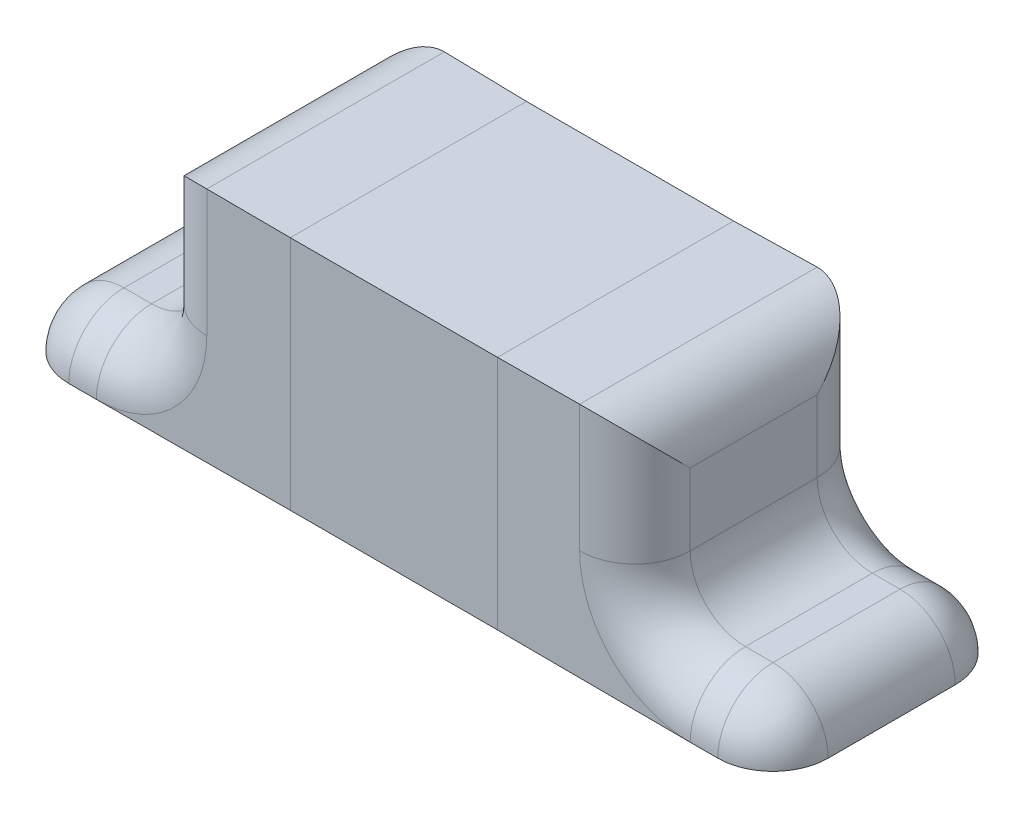
ISO-10303-21;
HEADER;
FILE_DESCRIPTION(('STEP AP214'),'2;1');
FILE_NAME('part.step','',(''),(''),'','','');
FILE_SCHEMA(('AUTOMOTIVE_DESIGN { 1 0 10303 214 1 1 1 1 }'));
ENDSEC;
DATA;
#1=APPLICATION_CONTEXT('core data for automotive mechanical design processes');
#2=APPLICATION_PROTOCOL_DEFINITION('international standard','automotive_design',2000,#1);
#3=PRODUCT_CONTEXT('',#1,'mechanical');
#4=PRODUCT('Part','Part','',(#3));
#5=PRODUCT_RELATED_PRODUCT_CATEGORY('part','',(#4));
#6=PRODUCT_DEFINITION_FORMATION('','',#4);
#7=PRODUCT_DEFINITION_CONTEXT('part definition',#1,'design');
#8=PRODUCT_DEFINITION('design','',#6,#7);
#9=PRODUCT_DEFINITION_SHAPE('','',#8);
#10=(LENGTH_UNIT() NAMED_UNIT(*) SI_UNIT(.MILLI.,.METRE.));
#11=(NAMED_UNIT(*) PLANE_ANGLE_UNIT() SI_UNIT($,.RADIAN.));
#12=(NAMED_UNIT(*) SI_UNIT($,.STERADIAN.) SOLID_ANGLE_UNIT());
#13=UNCERTAINTY_MEASURE_WITH_UNIT(LENGTH_MEASURE(1.E-05),#10,'distance_accuracy_value','');
#14=(GEOMETRIC_REPRESENTATION_CONTEXT(3) GLOBAL_UNCERTAINTY_ASSIGNED_CONTEXT((#13)) GLOBAL_UNIT_ASSIGNED_CONTEXT((#10,
#11,#12)) REPRESENTATION_CONTEXT('',''));
#15=CARTESIAN_POINT('',(0.,0.,0.));
#16=DIRECTION('',(0.,0.,1.));
#17=DIRECTION('',(1.,0.,0.));
#18=AXIS2_PLACEMENT_3D('',#15,#16,#17);
#19=CARTESIAN_POINT('',(0.875,0.,0.));
#20=DIRECTION('',(-1.,0.,0.));
#21=DIRECTION('',(0.,0.,1.));
#22=AXIS2_PLACEMENT_3D('',#19,#20,#21);
#23=PLANE('',#22);
#24=DIRECTION('',(0.,1.,0.));
#25=VECTOR('',#24,1.);
#26=CARTESIAN_POINT('',(0.875,0.,-0.23));
#27=LINE('',#26,#25);
#28=CARTESIAN_POINT('',(0.875,0.398442990090282,-0.23));
#29=VERTEX_POINT('',#28);
#30=CARTESIAN_POINT('',(0.875,0.658442990090282,-0.23));
#31=VERTEX_POINT('',#30);
#32=EDGE_CURVE('E897',#29,#31,#27,.T.);
#33=ORIENTED_EDGE('',*,*,#32,.T.);
#34=DIRECTION('',(0.,0.,1.));
#35=VECTOR('',#34,1.);
#36=CARTESIAN_POINT('',(0.875,0.658442990090282,0.));
#37=LINE('',#36,#35);
#38=CARTESIAN_POINT('',(0.875,0.658442990090282,0.23));
#39=VERTEX_POINT('',#38);
#40=EDGE_CURVE('E455',#31,#39,#37,.T.);
#41=ORIENTED_EDGE('',*,*,#40,.T.);
#42=DIRECTION('',(0.,-1.,0.));
#43=VECTOR('',#42,1.);
#44=CARTESIAN_POINT('',(0.875,0.,0.23));
#45=LINE('',#44,#43);
#46=CARTESIAN_POINT('',(0.875,0.398442990090282,0.23));
#47=VERTEX_POINT('',#46);
#48=EDGE_CURVE('E919',#39,#47,#45,.T.);
#49=ORIENTED_EDGE('',*,*,#48,.T.);
#50=DIRECTION('',(0.,0.,1.));
#51=VECTOR('',#50,1.);
#52=CARTESIAN_POINT('',(0.875,0.398442990090282,-0.43));
#53=LINE('',#52,#51);
#54=EDGE_CURVE('E250',#47,#29,#53,.F.);
#55=ORIENTED_EDGE('',*,*,#54,.T.);
#56=EDGE_LOOP('',(#33,#41,#49,#55));
#57=FACE_BOUND('',#56,.T.);
#58=ADVANCED_FACE('F39',(#57),#23,.F.);
#59=CARTESIAN_POINT('',(0.375,0.,-0.425));
#60=DIRECTION('',(0.,0.,1.));
#61=DIRECTION('',(1.,0.,0.));
#62=AXIS2_PLACEMENT_3D('',#59,#60,#61);
#63=PLANE('',#62);
#64=CARTESIAN_POINT('',(-0.375,0.,-0.425));
#65=DIRECTION('',(0.,1.,0.));
#66=VECTOR('',#65,1.);
#67=LINE('',#64,#66);
#68=CARTESIAN_POINT('',(-0.375,-0.000778504954858498,-0.4275));
#69=VERTEX_POINT('',#68);
#70=CARTESIAN_POINT('',(-0.375,0.854221495045141,-0.4275));
#71=VERTEX_POINT('',#70);
#72=EDGE_CURVE('E202',#69,#71,#67,.T.);
#73=ORIENTED_EDGE('',*,*,#72,.T.);
#74=DIRECTION('',(-1.,0.,0.));
#75=VECTOR('',#74,1.);
#76=CARTESIAN_POINT('',(0.375,0.850000000000001,-0.425));
#77=LINE('',#76,#75);
#78=CARTESIAN_POINT('',(0.375,0.854221495045141,-0.4275));
#79=VERTEX_POINT('',#78);
#80=EDGE_CURVE('E247',#79,#71,#77,.T.);
#81=ORIENTED_EDGE('',*,*,#80,.F.);
#82=CARTESIAN_POINT('',(0.375,-0.00155700990971792,-0.43));
#83=DIRECTION('',(0.,1.,0.));
#84=VECTOR('',#83,1.);
#85=LINE('',#82,#84);
#86=CARTESIAN_POINT('',(0.375,-0.000778504954858498,-0.4275));
#87=VERTEX_POINT('',#86);
#88=EDGE_CURVE('E227',#87,#79,#85,.T.);
#89=ORIENTED_EDGE('',*,*,#88,.F.);
#90=DIRECTION('',(-1.,0.,0.));
#91=VECTOR('',#90,1.);
#92=CARTESIAN_POINT('',(0.375,0.,-0.425));
#93=LINE('',#92,#91);
#94=EDGE_CURVE('E223',#87,#69,#93,.T.);
#95=ORIENTED_EDGE('',*,*,#94,.T.);
#96=EDGE_LOOP('',(#73,#81,#89,#95));
#97=FACE_BOUND('',#96,.T.);
#98=ADVANCED_FACE('F232',(#97),#63,.F.);
#99=CARTESIAN_POINT('',(0.375,0.850000000000001,0.425));
#100=DIRECTION('',(0.,-1.,0.));
#101=DIRECTION('',(0.,0.,-1.));
#102=AXIS2_PLACEMENT_3D('',#99,#100,#101);
#103=PLANE('',#102);
#104=CARTESIAN_POINT('',(-0.375,0.850000000000001,-0.425));
#105=DIRECTION('',(0.,0.,1.));
#106=VECTOR('',#105,1.);
#107=LINE('',#104,#106);
#108=CARTESIAN_POINT('',(-0.375,0.854221495045141,0.4275));
#109=VERTEX_POINT('',#108);
#110=EDGE_CURVE('E213',#71,#109,#107,.T.);
#111=ORIENTED_EDGE('',*,*,#110,.T.);
#112=DIRECTION('',(-1.,0.,0.));
#113=VECTOR('',#112,1.);
#114=CARTESIAN_POINT('',(0.375,0.850000000000001,0.425));
#115=LINE('',#114,#113);
#116=CARTESIAN_POINT('',(0.375,0.854221495045141,0.4275));
#117=VERTEX_POINT('',#116);
#118=EDGE_CURVE('E237',#117,#109,#115,.T.);
#119=ORIENTED_EDGE('',*,*,#118,.F.);
#120=CARTESIAN_POINT('',(0.375,0.858442990090282,-0.43));
#121=DIRECTION('',(0.,0.,1.));
#122=VECTOR('',#121,1.);
#123=LINE('',#120,#122);
#124=EDGE_CURVE('E258',#79,#117,#123,.T.);
#125=ORIENTED_EDGE('',*,*,#124,.F.);
#126=ORIENTED_EDGE('',*,*,#80,.T.);
#127=EDGE_LOOP('',(#111,#119,#125,#126));
#128=FACE_BOUND('',#127,.T.);
#129=ADVANCED_FACE('F264',(#128),#103,.F.);
#130=CARTESIAN_POINT('',(0.375,0.,0.425));
#131=DIRECTION('',(0.,0.,-1.));
#132=DIRECTION('',(-1.,0.,0.));
#133=AXIS2_PLACEMENT_3D('',#130,#131,#132);
#134=PLANE('',#133);
#135=CARTESIAN_POINT('',(-0.375,0.850000000000001,0.425));
#136=DIRECTION('',(0.,-1.,0.));
#137=VECTOR('',#136,1.);
#138=LINE('',#135,#137);
#139=CARTESIAN_POINT('',(-0.375,-0.000778504954858524,0.4275));
#140=VERTEX_POINT('',#139);
#141=EDGE_CURVE('E228',#109,#140,#138,.T.);
#142=ORIENTED_EDGE('',*,*,#141,.T.);
#143=DIRECTION('',(-1.,0.,0.));
#144=VECTOR('',#143,1.);
#145=CARTESIAN_POINT('',(0.375,0.,0.425));
#146=LINE('',#145,#144);
#147=CARTESIAN_POINT('',(0.375,-0.000778504954858524,0.4275));
#148=VERTEX_POINT('',#147);
#149=EDGE_CURVE('E226',#148,#140,#146,.T.);
#150=ORIENTED_EDGE('',*,*,#149,.F.);
#151=CARTESIAN_POINT('',(0.375,0.858442990090282,0.43));
#152=DIRECTION('',(0.,-1.,0.));
#153=VECTOR('',#152,1.);
#154=LINE('',#151,#153);
#155=EDGE_CURVE('E239',#117,#148,#154,.T.);
#156=ORIENTED_EDGE('',*,*,#155,.F.);
#157=ORIENTED_EDGE('',*,*,#118,.T.);
#158=EDGE_LOOP('',(#142,#150,#156,#157));
#159=FACE_BOUND('',#158,.T.);
#160=ADVANCED_FACE('F273',(#159),#134,.F.);
#161=CARTESIAN_POINT('',(0.375,0.,0.425));
#162=DIRECTION('',(0.,1.,0.));
#163=DIRECTION('',(0.,0.,1.));
#164=AXIS2_PLACEMENT_3D('',#161,#162,#163);
#165=PLANE('',#164);
#166=CARTESIAN_POINT('',(-0.375,0.,0.425));
#167=DIRECTION('',(0.,0.,-1.));
#168=VECTOR('',#167,1.);
#169=LINE('',#166,#168);
#170=EDGE_CURVE('E192',#140,#69,#169,.T.);
#171=ORIENTED_EDGE('',*,*,#170,.T.);
#172=ORIENTED_EDGE('',*,*,#94,.F.);
#173=CARTESIAN_POINT('',(0.375,-0.00155700990971797,0.43));
#174=DIRECTION('',(0.,0.,-1.));
#175=VECTOR('',#174,1.);
#176=LINE('',#173,#175);
#177=EDGE_CURVE('E235',#148,#87,#176,.T.);
#178=ORIENTED_EDGE('',*,*,#177,.F.);
#179=ORIENTED_EDGE('',*,*,#149,.T.);
#180=EDGE_LOOP('',(#171,#172,#178,#179));
#181=FACE_BOUND('',#180,.T.);
#182=ADVANCED_FACE('F221',(#181),#165,.F.);
#183=CARTESIAN_POINT('',(0.875,-0.00155700990971792,-0.43));
#184=DIRECTION('',(0.,0.,1.));
#185=DIRECTION('',(1.,0.,0.));
#186=AXIS2_PLACEMENT_3D('',#183,#184,#185);
#187=PLANE('',#186);
#188=DIRECTION('',(-1.,0.,0.));
#189=VECTOR('',#188,1.);
#190=CARTESIAN_POINT('',(0.875,0.858442990090282,-0.43));
#191=LINE('',#190,#189);
#192=CARTESIAN_POINT('',(0.675,0.858442990090282,-0.43));
#193=VERTEX_POINT('',#192);
#194=EDGE_CURVE('E214',#193,#79,#191,.T.);
#195=ORIENTED_EDGE('',*,*,#194,.F.);
#196=DIRECTION('',(0.,1.,0.));
#197=VECTOR('',#196,1.);
#198=CARTESIAN_POINT('',(0.675,-0.00155700990971792,-0.43));
#199=LINE('',#198,#197);
#200=CARTESIAN_POINT('',(0.675,0.398442990090282,-0.43));
#201=VERTEX_POINT('',#200);
#202=EDGE_CURVE('E454',#193,#201,#199,.F.);
#203=ORIENTED_EDGE('',*,*,#202,.T.);
#204=CARTESIAN_POINT('',(1.075,0.398442990090282,-0.43));
#205=DIRECTION('',(0.,0.,1.));
#206=DIRECTION('',(1.,0.,0.));
#207=AXIS2_PLACEMENT_3D('',#204,#205,#206);
#208=CIRCLE('',#207,0.4);
#209=CARTESIAN_POINT('',(1.075,-0.00155700990971792,-0.43));
#210=VERTEX_POINT('',#209);
#211=EDGE_CURVE('E451',#210,#201,#208,.F.);
#212=ORIENTED_EDGE('',*,*,#211,.F.);
#213=DIRECTION('',(-1.,0.,0.));
#214=VECTOR('',#213,1.);
#215=CARTESIAN_POINT('',(0.875,-0.00155700990971792,-0.43));
#216=LINE('',#215,#214);
#217=EDGE_CURVE('E446',#210,#87,#216,.T.);
#218=ORIENTED_EDGE('',*,*,#217,.T.);
#219=ORIENTED_EDGE('',*,*,#88,.T.);
#220=EDGE_LOOP('',(#195,#203,#212,#218,#219));
#221=FACE_BOUND('',#220,.T.);
#222=ADVANCED_FACE('F422',(#221),#187,.F.);
#223=CARTESIAN_POINT('',(0.875,0.858442990090282,0.43));
#224=DIRECTION('',(0.,-1.,0.));
#225=DIRECTION('',(0.,0.,-1.));
#226=AXIS2_PLACEMENT_3D('',#223,#224,#225);
#227=PLANE('',#226);
#228=DIRECTION('',(-1.,0.,0.));
#229=VECTOR('',#228,1.);
#230=CARTESIAN_POINT('',(0.875,0.858442990090282,0.43));
#231=LINE('',#230,#229);
#232=CARTESIAN_POINT('',(0.675,0.858442990090282,0.43));
#233=VERTEX_POINT('',#232);
#234=EDGE_CURVE('E400',#233,#117,#231,.T.);
#235=ORIENTED_EDGE('',*,*,#234,.F.);
#236=DIRECTION('',(0.,0.,1.));
#237=VECTOR('',#236,1.);
#238=CARTESIAN_POINT('',(0.675,0.858442990090282,0.43));
#239=LINE('',#238,#237);
#240=EDGE_CURVE('E912',#233,#193,#239,.F.);
#241=ORIENTED_EDGE('',*,*,#240,.T.);
#242=ORIENTED_EDGE('',*,*,#194,.T.);
#243=ORIENTED_EDGE('',*,*,#124,.T.);
#244=EDGE_LOOP('',(#235,#241,#242,#243));
#245=FACE_BOUND('',#244,.T.);
#246=ADVANCED_FACE('F399',(#245),#227,.F.);
#247=CARTESIAN_POINT('',(0.875,-0.00155700990971797,0.43));
#248=DIRECTION('',(0.,0.,-1.));
#249=DIRECTION('',(-1.,0.,0.));
#250=AXIS2_PLACEMENT_3D('',#247,#248,#249);
#251=PLANE('',#250);
#252=CARTESIAN_POINT('',(1.075,0.398442990090282,0.43));
#253=DIRECTION('',(0.,0.,-1.));
#254=DIRECTION('',(-1.,0.,0.));
#255=AXIS2_PLACEMENT_3D('',#252,#253,#254);
#256=CIRCLE('',#255,0.4);
#257=CARTESIAN_POINT('',(0.675,0.398442990090282,0.43));
#258=VERTEX_POINT('',#257);
#259=CARTESIAN_POINT('',(1.075,-0.00155700990971797,0.43));
#260=VERTEX_POINT('',#259);
#261=EDGE_CURVE('E458',#258,#260,#256,.F.);
#262=ORIENTED_EDGE('',*,*,#261,.F.);
#263=DIRECTION('',(0.,-1.,0.));
#264=VECTOR('',#263,1.);
#265=CARTESIAN_POINT('',(0.675,-0.00155700990971797,0.43));
#266=LINE('',#265,#264);
#267=EDGE_CURVE('E914',#258,#233,#266,.F.);
#268=ORIENTED_EDGE('',*,*,#267,.T.);
#269=ORIENTED_EDGE('',*,*,#234,.T.);
#270=ORIENTED_EDGE('',*,*,#155,.T.);
#271=DIRECTION('',(-1.,0.,0.));
#272=VECTOR('',#271,1.);
#273=CARTESIAN_POINT('',(0.875,-0.00155700990971797,0.43));
#274=LINE('',#273,#272);
#275=EDGE_CURVE('E459',#260,#148,#274,.T.);
#276=ORIENTED_EDGE('',*,*,#275,.F.);
#277=EDGE_LOOP('',(#262,#268,#269,#270,#276));
#278=FACE_BOUND('',#277,.T.);
#279=ADVANCED_FACE('F421',(#278),#251,.F.);
#280=CARTESIAN_POINT('',(0.875,-0.00155700990971797,0.43));
#281=DIRECTION('',(0.,1.,0.));
#282=DIRECTION('',(0.,0.,1.));
#283=AXIS2_PLACEMENT_3D('',#280,#281,#282);
#284=PLANE('',#283);
#285=CARTESIAN_POINT('',(1.175,-0.00155700990971792,-0.43));
#286=VERTEX_POINT('',#285);
#287=EDGE_CURVE('E442',#286,#210,#216,.T.);
#288=ORIENTED_EDGE('',*,*,#287,.F.);
#289=CARTESIAN_POINT('',(1.175,-0.00155700990971793,-0.23));
#290=DIRECTION('',(0.,1.,0.));
#291=DIRECTION('',(0.,0.,1.));
#292=AXIS2_PLACEMENT_3D('',#289,#290,#291);
#293=CIRCLE('',#292,0.2);
#294=CARTESIAN_POINT('',(1.375,-0.00155700990971797,-0.23));
#295=VERTEX_POINT('',#294);
#296=EDGE_CURVE('E476',#286,#295,#293,.F.);
#297=ORIENTED_EDGE('',*,*,#296,.T.);
#298=DIRECTION('',(0.,0.,-1.));
#299=VECTOR('',#298,1.);
#300=CARTESIAN_POINT('',(1.375,-0.00155700990971797,0.43));
#301=LINE('',#300,#299);
#302=CARTESIAN_POINT('',(1.375,-0.00155700990971797,0.23));
#303=VERTEX_POINT('',#302);
#304=EDGE_CURVE('E449',#303,#295,#301,.T.);
#305=ORIENTED_EDGE('',*,*,#304,.F.);
#306=CARTESIAN_POINT('',(1.175,-0.00155700990971796,0.23));
#307=DIRECTION('',(0.,1.,0.));
#308=DIRECTION('',(0.,0.,1.));
#309=AXIS2_PLACEMENT_3D('',#306,#307,#308);
#310=CIRCLE('',#309,0.2);
#311=CARTESIAN_POINT('',(1.175,-0.00155700990971797,0.43));
#312=VERTEX_POINT('',#311);
#313=EDGE_CURVE('E474',#303,#312,#310,.F.);
#314=ORIENTED_EDGE('',*,*,#313,.T.);
#315=EDGE_CURVE('E462',#312,#260,#274,.T.);
#316=ORIENTED_EDGE('',*,*,#315,.T.);
#317=ORIENTED_EDGE('',*,*,#275,.T.);
#318=ORIENTED_EDGE('',*,*,#177,.T.);
#319=ORIENTED_EDGE('',*,*,#217,.F.);
#320=EDGE_LOOP('',(#288,#297,#305,#314,#316,#317,#318,#319));
#321=FACE_BOUND('',#320,.T.);
#322=ADVANCED_FACE('F546',(#321),#284,.F.);
#323=CARTESIAN_POINT('',(1.375,0.198442990090282,0.43));
#324=DIRECTION('',(0.,-1.,0.));
#325=DIRECTION('',(0.,0.,-1.));
#326=AXIS2_PLACEMENT_3D('',#323,#324,#325);
#327=PLANE('',#326);
#328=DIRECTION('',(-1.,0.,0.));
#329=VECTOR('',#328,1.);
#330=CARTESIAN_POINT('',(1.375,0.198442990090282,-0.23));
#331=LINE('',#330,#329);
#332=CARTESIAN_POINT('',(1.175,0.198442990090282,-0.23));
#333=VERTEX_POINT('',#332);
#334=CARTESIAN_POINT('',(1.075,0.198442990090282,-0.23));
#335=VERTEX_POINT('',#334);
#336=EDGE_CURVE('E904',#333,#335,#331,.T.);
#337=ORIENTED_EDGE('',*,*,#336,.T.);
#338=DIRECTION('',(0.,0.,1.));
#339=VECTOR('',#338,1.);
#340=CARTESIAN_POINT('',(1.075,0.198442990090282,0.43));
#341=LINE('',#340,#339);
#342=CARTESIAN_POINT('',(1.075,0.198442990090282,0.23));
#343=VERTEX_POINT('',#342);
#344=EDGE_CURVE('E902',#335,#343,#341,.T.);
#345=ORIENTED_EDGE('',*,*,#344,.T.);
#346=DIRECTION('',(-1.,0.,0.));
#347=VECTOR('',#346,1.);
#348=CARTESIAN_POINT('',(1.375,0.198442990090282,0.23));
#349=LINE('',#348,#347);
#350=CARTESIAN_POINT('',(1.175,0.198442990090282,0.23));
#351=VERTEX_POINT('',#350);
#352=EDGE_CURVE('E907',#343,#351,#349,.F.);
#353=ORIENTED_EDGE('',*,*,#352,.T.);
#354=DIRECTION('',(0.,0.,1.));
#355=VECTOR('',#354,1.);
#356=CARTESIAN_POINT('',(1.175,0.198442990090282,0.43));
#357=LINE('',#356,#355);
#358=EDGE_CURVE('E909',#351,#333,#357,.F.);
#359=ORIENTED_EDGE('',*,*,#358,.T.);
#360=EDGE_LOOP('',(#337,#345,#353,#359));
#361=FACE_BOUND('',#360,.T.);
#362=ADVANCED_FACE('F545',(#361),#327,.F.);
#363=CARTESIAN_POINT('',(0.875,-0.00155700990971797,0.23));
#364=DIRECTION('',(-1.,0.,0.));
#365=DIRECTION('',(0.,0.,1.));
#366=AXIS2_PLACEMENT_3D('',#363,#364,#365);
#367=CYLINDRICAL_SURFACE('',#366,0.2);
#368=ORIENTED_EDGE('',*,*,#315,.F.);
#369=CARTESIAN_POINT('',(1.175,-0.00155700990971797,0.23));
#370=DIRECTION('',(-1.,0.,0.));
#371=DIRECTION('',(0.,0.,1.));
#372=AXIS2_PLACEMENT_3D('',#369,#370,#371);
#373=CIRCLE('',#372,0.2);
#374=EDGE_CURVE('E483',#312,#351,#373,.T.);
#375=ORIENTED_EDGE('',*,*,#374,.T.);
#376=ORIENTED_EDGE('',*,*,#352,.F.);
#377=CARTESIAN_POINT('',(1.075,-0.00155700990971797,0.23));
#378=DIRECTION('',(-1.,0.,0.));
#379=DIRECTION('',(0.,0.,1.));
#380=AXIS2_PLACEMENT_3D('',#377,#378,#379);
#381=CIRCLE('',#380,0.2);
#382=EDGE_CURVE('E595',#260,#343,#381,.T.);
#383=ORIENTED_EDGE('',*,*,#382,.F.);
#384=EDGE_LOOP('',(#368,#375,#376,#383));
#385=FACE_BOUND('',#384,.T.);
#386=ADVANCED_FACE('F561',(#385),#367,.T.);
#387=CARTESIAN_POINT('',(1.175,-0.00155700990971797,0.));
#388=DIRECTION('',(0.,0.,1.));
#389=DIRECTION('',(1.,0.,0.));
#390=AXIS2_PLACEMENT_3D('',#387,#388,#389);
#391=CYLINDRICAL_SURFACE('',#390,0.2);
#392=ORIENTED_EDGE('',*,*,#304,.T.);
#393=CARTESIAN_POINT('',(1.175,-0.00155700990971797,-0.23));
#394=DIRECTION('',(0.,0.,1.));
#395=DIRECTION('',(1.,0.,0.));
#396=AXIS2_PLACEMENT_3D('',#393,#394,#395);
#397=CIRCLE('',#396,0.2);
#398=EDGE_CURVE('E481',#295,#333,#397,.T.);
#399=ORIENTED_EDGE('',*,*,#398,.T.);
#400=ORIENTED_EDGE('',*,*,#358,.F.);
#401=CARTESIAN_POINT('',(1.175,-0.00155700990971797,0.23));
#402=DIRECTION('',(0.,0.,1.));
#403=DIRECTION('',(1.,0.,0.));
#404=AXIS2_PLACEMENT_3D('',#401,#402,#403);
#405=CIRCLE('',#404,0.2);
#406=EDGE_CURVE('E478',#351,#303,#405,.F.);
#407=ORIENTED_EDGE('',*,*,#406,.T.);
#408=EDGE_LOOP('',(#392,#399,#400,#407));
#409=FACE_BOUND('',#408,.T.);
#410=ADVANCED_FACE('F862',(#409),#391,.T.);
#411=CARTESIAN_POINT('',(1.075,0.398442990090282,0.23));
#412=DIRECTION('',(0.,0.,-1.));
#413=DIRECTION('',(-1.,0.,0.));
#414=AXIS2_PLACEMENT_3D('',#411,#412,#413);
#415=TOROIDAL_SURFACE('',#414,0.4,0.2);
#416=ORIENTED_EDGE('',*,*,#261,.T.);
#417=ORIENTED_EDGE('',*,*,#382,.T.);
#418=CARTESIAN_POINT('',(1.075,0.398442990090282,0.23));
#419=DIRECTION('',(0.,0.,-1.));
#420=DIRECTION('',(-1.,0.,0.));
#421=AXIS2_PLACEMENT_3D('',#418,#419,#420);
#422=CIRCLE('',#421,0.2);
#423=EDGE_CURVE('E588',#47,#343,#422,.F.);
#424=ORIENTED_EDGE('',*,*,#423,.F.);
#425=CARTESIAN_POINT('',(0.675,0.398442990090282,0.23));
#426=DIRECTION('',(0.,-1.,0.));
#427=DIRECTION('',(0.,0.,-1.));
#428=AXIS2_PLACEMENT_3D('',#425,#426,#427);
#429=CIRCLE('',#428,0.2);
#430=EDGE_CURVE('E585',#258,#47,#429,.F.);
#431=ORIENTED_EDGE('',*,*,#430,.F.);
#432=EDGE_LOOP('',(#416,#417,#424,#431));
#433=FACE_BOUND('',#432,.T.);
#434=ADVANCED_FACE('F853',(#433),#415,.T.);
#435=CARTESIAN_POINT('',(1.375,-0.00155700990971797,-0.23));
#436=DIRECTION('',(-1.,0.,0.));
#437=DIRECTION('',(0.,0.,1.));
#438=AXIS2_PLACEMENT_3D('',#435,#436,#437);
#439=CYLINDRICAL_SURFACE('',#438,0.2);
#440=ORIENTED_EDGE('',*,*,#336,.F.);
#441=CARTESIAN_POINT('',(1.175,-0.00155700990971797,-0.23));
#442=DIRECTION('',(-1.,0.,0.));
#443=DIRECTION('',(0.,0.,1.));
#444=AXIS2_PLACEMENT_3D('',#441,#442,#443);
#445=CIRCLE('',#444,0.2);
#446=EDGE_CURVE('E473',#333,#286,#445,.T.);
#447=ORIENTED_EDGE('',*,*,#446,.T.);
#448=ORIENTED_EDGE('',*,*,#287,.T.);
#449=CARTESIAN_POINT('',(1.075,-0.00155700990971797,-0.23));
#450=DIRECTION('',(-1.,0.,0.));
#451=DIRECTION('',(0.,0.,1.));
#452=AXIS2_PLACEMENT_3D('',#449,#450,#451);
#453=CIRCLE('',#452,0.2);
#454=EDGE_CURVE('E574',#335,#210,#453,.T.);
#455=ORIENTED_EDGE('',*,*,#454,.F.);
#456=EDGE_LOOP('',(#440,#447,#448,#455));
#457=FACE_BOUND('',#456,.T.);
#458=ADVANCED_FACE('F573',(#457),#439,.T.);
#459=CARTESIAN_POINT('',(1.075,0.398442990090282,0.43));
#460=DIRECTION('',(0.,0.,-1.));
#461=DIRECTION('',(-1.,0.,0.));
#462=AXIS2_PLACEMENT_3D('',#459,#460,#461);
#463=CYLINDRICAL_SURFACE('',#462,0.2);
#464=ORIENTED_EDGE('',*,*,#423,.T.);
#465=ORIENTED_EDGE('',*,*,#344,.F.);
#466=CARTESIAN_POINT('',(1.075,0.398442990090282,-0.23));
#467=DIRECTION('',(0.,0.,1.));
#468=DIRECTION('',(1.,0.,0.));
#469=AXIS2_PLACEMENT_3D('',#466,#467,#468);
#470=CIRCLE('',#469,0.2);
#471=EDGE_CURVE('E584',#29,#335,#470,.T.);
#472=ORIENTED_EDGE('',*,*,#471,.F.);
#473=ORIENTED_EDGE('',*,*,#54,.F.);
#474=EDGE_LOOP('',(#464,#465,#472,#473));
#475=FACE_BOUND('',#474,.T.);
#476=ADVANCED_FACE('F852',(#475),#463,.F.);
#477=CARTESIAN_POINT('',(0.675,0.,0.23));
#478=DIRECTION('',(0.,-1.,0.));
#479=DIRECTION('',(0.,0.,-1.));
#480=AXIS2_PLACEMENT_3D('',#477,#478,#479);
#481=CYLINDRICAL_SURFACE('',#480,0.2);
#482=ORIENTED_EDGE('',*,*,#430,.T.);
#483=ORIENTED_EDGE('',*,*,#48,.F.);
#484=CARTESIAN_POINT('',(0.675,0.658442990090282,0.23));
#485=DIRECTION('',(0.,-0.707106781186547,0.707106781186547));
#486=DIRECTION('',(0.,0.707106781186547,0.707106781186547));
#487=AXIS2_PLACEMENT_3D('',#484,#485,#486);
#488=ELLIPSE('',#487,0.282842712474619,0.2);
#489=EDGE_CURVE('E590',#233,#39,#488,.F.);
#490=ORIENTED_EDGE('',*,*,#489,.F.);
#491=ORIENTED_EDGE('',*,*,#267,.F.);
#492=EDGE_LOOP('',(#482,#483,#490,#491));
#493=FACE_BOUND('',#492,.T.);
#494=ADVANCED_FACE('F884',(#493),#481,.T.);
#495=CARTESIAN_POINT('',(1.075,0.398442990090282,-0.23));
#496=DIRECTION('',(0.,0.,1.));
#497=DIRECTION('',(1.,0.,0.));
#498=AXIS2_PLACEMENT_3D('',#495,#496,#497);
#499=TOROIDAL_SURFACE('',#498,0.4,0.2);
#500=ORIENTED_EDGE('',*,*,#454,.T.);
#501=ORIENTED_EDGE('',*,*,#211,.T.);
#502=CARTESIAN_POINT('',(0.675,0.398442990090282,-0.23));
#503=DIRECTION('',(0.,-1.,0.));
#504=DIRECTION('',(0.,0.,-1.));
#505=AXIS2_PLACEMENT_3D('',#502,#503,#504);
#506=CIRCLE('',#505,0.2);
#507=EDGE_CURVE('E581',#29,#201,#506,.F.);
#508=ORIENTED_EDGE('',*,*,#507,.F.);
#509=ORIENTED_EDGE('',*,*,#471,.T.);
#510=EDGE_LOOP('',(#500,#501,#508,#509));
#511=FACE_BOUND('',#510,.T.);
#512=ADVANCED_FACE('F580',(#511),#499,.T.);
#513=CARTESIAN_POINT('',(0.675,0.658442990090282,0.));
#514=DIRECTION('',(0.,0.,1.));
#515=DIRECTION('',(1.,0.,0.));
#516=AXIS2_PLACEMENT_3D('',#513,#514,#515);
#517=CYLINDRICAL_SURFACE('',#516,0.2);
#518=ORIENTED_EDGE('',*,*,#489,.T.);
#519=ORIENTED_EDGE('',*,*,#40,.F.);
#520=CARTESIAN_POINT('',(0.675,0.658442990090282,-0.23));
#521=DIRECTION('',(0.,0.707106781186547,0.707106781186547));
#522=DIRECTION('',(0.,-0.707106781186547,0.707106781186547));
#523=AXIS2_PLACEMENT_3D('',#520,#521,#522);
#524=ELLIPSE('',#523,0.282842712474619,0.2);
#525=EDGE_CURVE('E303',#193,#31,#524,.F.);
#526=ORIENTED_EDGE('',*,*,#525,.F.);
#527=ORIENTED_EDGE('',*,*,#240,.F.);
#528=EDGE_LOOP('',(#518,#519,#526,#527));
#529=FACE_BOUND('',#528,.T.);
#530=ADVANCED_FACE('F891',(#529),#517,.T.);
#531=CARTESIAN_POINT('',(0.675,0.,-0.23));
#532=DIRECTION('',(0.,1.,0.));
#533=DIRECTION('',(0.,0.,1.));
#534=AXIS2_PLACEMENT_3D('',#531,#532,#533);
#535=CYLINDRICAL_SURFACE('',#534,0.2);
#536=ORIENTED_EDGE('',*,*,#507,.T.);
#537=ORIENTED_EDGE('',*,*,#202,.F.);
#538=ORIENTED_EDGE('',*,*,#525,.T.);
#539=ORIENTED_EDGE('',*,*,#32,.F.);
#540=EDGE_LOOP('',(#536,#537,#538,#539));
#541=FACE_BOUND('',#540,.T.);
#542=ADVANCED_FACE('F641',(#541),#535,.T.);
#543=CARTESIAN_POINT('',(1.175,-0.00155700990971797,-0.23));
#544=DIRECTION('',(0.,0.,1.));
#545=DIRECTION('',(1.,0.,0.));
#546=AXIS2_PLACEMENT_3D('',#543,#544,#545);
#547=SPHERICAL_SURFACE('',#546,0.2);
#548=ORIENTED_EDGE('',*,*,#446,.F.);
#549=ORIENTED_EDGE('',*,*,#398,.F.);
#550=ORIENTED_EDGE('',*,*,#296,.F.);
#551=EDGE_LOOP('',(#548,#549,#550));
#552=FACE_BOUND('',#551,.T.);
#553=ADVANCED_FACE('F635',(#552),#547,.T.);
#554=CARTESIAN_POINT('',(1.175,-0.00155700990971797,0.23));
#555=DIRECTION('',(0.,0.,1.));
#556=DIRECTION('',(1.,0.,0.));
#557=AXIS2_PLACEMENT_3D('',#554,#555,#556);
#558=SPHERICAL_SURFACE('',#557,0.2);
#559=ORIENTED_EDGE('',*,*,#406,.F.);
#560=ORIENTED_EDGE('',*,*,#374,.F.);
#561=ORIENTED_EDGE('',*,*,#313,.F.);
#562=EDGE_LOOP('',(#559,#560,#561));
#563=FACE_BOUND('',#562,.T.);
#564=ADVANCED_FACE('F631',(#563),#558,.T.);
#565=CARTESIAN_POINT('',(-0.875,-0.00155700990971792,-0.43));
#566=DIRECTION('',(0.,0.,-1.));
#567=DIRECTION('',(-1.,0.,0.));
#568=AXIS2_PLACEMENT_3D('',#565,#566,#567);
#569=PLANE('',#568);
#570=CARTESIAN_POINT('',(-1.075,0.398442990090282,-0.43));
#571=DIRECTION('',(0.,0.,-1.));
#572=DIRECTION('',(-1.,0.,0.));
#573=AXIS2_PLACEMENT_3D('',#570,#571,#572);
#574=CIRCLE('',#573,0.4);
#575=CARTESIAN_POINT('',(-0.675,0.398442990090282,-0.43));
#576=VERTEX_POINT('',#575);
#577=CARTESIAN_POINT('',(-1.075,-0.00155700990971792,-0.43));
#578=VERTEX_POINT('',#577);
#579=EDGE_CURVE('E484',#576,#578,#574,.T.);
#580=ORIENTED_EDGE('',*,*,#579,.F.);
#581=DIRECTION('',(0.,1.,0.));
#582=VECTOR('',#581,1.);
#583=CARTESIAN_POINT('',(-0.675,0.858442990090282,-0.43));
#584=LINE('',#583,#582);
#585=CARTESIAN_POINT('',(-0.675,0.858442990090282,-0.43));
#586=VERTEX_POINT('',#585);
#587=EDGE_CURVE('E498',#576,#586,#584,.T.);
#588=ORIENTED_EDGE('',*,*,#587,.T.);
#589=DIRECTION('',(1.,0.,0.));
#590=VECTOR('',#589,1.);
#591=CARTESIAN_POINT('',(-0.875,0.858442990090282,-0.43));
#592=LINE('',#591,#590);
#593=EDGE_CURVE('E207',#586,#71,#592,.T.);
#594=ORIENTED_EDGE('',*,*,#593,.T.);
#595=ORIENTED_EDGE('',*,*,#72,.F.);
#596=DIRECTION('',(1.,0.,0.));
#597=VECTOR('',#596,1.);
#598=CARTESIAN_POINT('',(-0.875,-0.00155700990971792,-0.43));
#599=LINE('',#598,#597);
#600=EDGE_CURVE('E187',#578,#69,#599,.T.);
#601=ORIENTED_EDGE('',*,*,#600,.F.);
#602=EDGE_LOOP('',(#580,#588,#594,#595,#601));
#603=FACE_BOUND('',#602,.T.);
#604=ADVANCED_FACE('F204',(#603),#569,.T.);
#605=CARTESIAN_POINT('',(-0.875,-0.00155700990971797,0.43));
#606=DIRECTION('',(0.,-1.,0.));
#607=DIRECTION('',(0.,0.,-1.));
#608=AXIS2_PLACEMENT_3D('',#605,#606,#607);
#609=PLANE('',#608);
#610=DIRECTION('',(0.,0.,-1.));
#611=VECTOR('',#610,1.);
#612=CARTESIAN_POINT('',(-1.375,-0.00155700990971797,0.43));
#613=LINE('',#612,#611);
#614=CARTESIAN_POINT('',(-1.375,-0.00155700990971797,0.23));
#615=VERTEX_POINT('',#614);
#616=CARTESIAN_POINT('',(-1.375,-0.00155700990971797,-0.23));
#617=VERTEX_POINT('',#616);
#618=EDGE_CURVE('E373',#615,#617,#613,.T.);
#619=ORIENTED_EDGE('',*,*,#618,.T.);
#620=CARTESIAN_POINT('',(-1.175,-0.00155700990971793,-0.23));
#621=DIRECTION('',(0.,-1.,0.));
#622=DIRECTION('',(0.,0.,-1.));
#623=AXIS2_PLACEMENT_3D('',#620,#621,#622);
#624=CIRCLE('',#623,0.2);
#625=CARTESIAN_POINT('',(-1.175,-0.00155700990971792,-0.43));
#626=VERTEX_POINT('',#625);
#627=EDGE_CURVE('E47',#617,#626,#624,.T.);
#628=ORIENTED_EDGE('',*,*,#627,.T.);
#629=EDGE_CURVE('E196',#626,#578,#599,.T.);
#630=ORIENTED_EDGE('',*,*,#629,.T.);
#631=ORIENTED_EDGE('',*,*,#600,.T.);
#632=ORIENTED_EDGE('',*,*,#170,.F.);
#633=DIRECTION('',(1.,0.,0.));
#634=VECTOR('',#633,1.);
#635=CARTESIAN_POINT('',(-0.875,-0.00155700990971797,0.43));
#636=LINE('',#635,#634);
#637=CARTESIAN_POINT('',(-1.075,-0.00155700990971797,0.43));
#638=VERTEX_POINT('',#637);
#639=EDGE_CURVE('E317',#638,#140,#636,.T.);
#640=ORIENTED_EDGE('',*,*,#639,.F.);
#641=CARTESIAN_POINT('',(-1.175,-0.00155700990971797,0.43));
#642=VERTEX_POINT('',#641);
#643=EDGE_CURVE('E199',#642,#638,#636,.T.);
#644=ORIENTED_EDGE('',*,*,#643,.F.);
#645=CARTESIAN_POINT('',(-1.175,-0.00155700990971796,0.23));
#646=DIRECTION('',(0.,-1.,0.));
#647=DIRECTION('',(0.,0.,-1.));
#648=AXIS2_PLACEMENT_3D('',#645,#646,#647);
#649=CIRCLE('',#648,0.2);
#650=EDGE_CURVE('E314',#642,#615,#649,.T.);
#651=ORIENTED_EDGE('',*,*,#650,.T.);
#652=EDGE_LOOP('',(#619,#628,#630,#631,#632,#640,#644,#651));
#653=FACE_BOUND('',#652,.T.);
#654=ADVANCED_FACE('F189',(#653),#609,.T.);
#655=CARTESIAN_POINT('',(-0.875,-0.00155700990971797,0.43));
#656=DIRECTION('',(0.,0.,1.));
#657=DIRECTION('',(1.,0.,0.));
#658=AXIS2_PLACEMENT_3D('',#655,#656,#657);
#659=PLANE('',#658);
#660=DIRECTION('',(1.,0.,0.));
#661=VECTOR('',#660,1.);
#662=CARTESIAN_POINT('',(-0.875,0.858442990090282,0.43));
#663=LINE('',#662,#661);
#664=CARTESIAN_POINT('',(-0.675,0.858442990090282,0.43));
#665=VERTEX_POINT('',#664);
#666=EDGE_CURVE('E330',#665,#109,#663,.T.);
#667=ORIENTED_EDGE('',*,*,#666,.F.);
#668=DIRECTION('',(0.,-1.,0.));
#669=VECTOR('',#668,1.);
#670=CARTESIAN_POINT('',(-0.675,0.198442990090282,0.43));
#671=LINE('',#670,#669);
#672=CARTESIAN_POINT('',(-0.675,0.398442990090282,0.43));
#673=VERTEX_POINT('',#672);
#674=EDGE_CURVE('E336',#665,#673,#671,.T.);
#675=ORIENTED_EDGE('',*,*,#674,.T.);
#676=CARTESIAN_POINT('',(-1.075,0.398442990090282,0.43));
#677=DIRECTION('',(0.,0.,1.));
#678=DIRECTION('',(1.,0.,0.));
#679=AXIS2_PLACEMENT_3D('',#676,#677,#678);
#680=CIRCLE('',#679,0.4);
#681=EDGE_CURVE('E333',#638,#673,#680,.T.);
#682=ORIENTED_EDGE('',*,*,#681,.F.);
#683=ORIENTED_EDGE('',*,*,#639,.T.);
#684=ORIENTED_EDGE('',*,*,#141,.F.);
#685=EDGE_LOOP('',(#667,#675,#682,#683,#684));
#686=FACE_BOUND('',#685,.T.);
#687=ADVANCED_FACE('F384',(#686),#659,.T.);
#688=CARTESIAN_POINT('',(-0.875,0.858442990090282,0.43));
#689=DIRECTION('',(0.,1.,0.));
#690=DIRECTION('',(0.,0.,1.));
#691=AXIS2_PLACEMENT_3D('',#688,#689,#690);
#692=PLANE('',#691);
#693=ORIENTED_EDGE('',*,*,#593,.F.);
#694=DIRECTION('',(0.,0.,1.));
#695=VECTOR('',#694,1.);
#696=CARTESIAN_POINT('',(-0.675,0.858442990090282,0.43));
#697=LINE('',#696,#695);
#698=EDGE_CURVE('E339',#586,#665,#697,.T.);
#699=ORIENTED_EDGE('',*,*,#698,.T.);
#700=ORIENTED_EDGE('',*,*,#666,.T.);
#701=ORIENTED_EDGE('',*,*,#110,.F.);
#702=EDGE_LOOP('',(#693,#699,#700,#701));
#703=FACE_BOUND('',#702,.T.);
#704=ADVANCED_FACE('F379',(#703),#692,.T.);
#705=CARTESIAN_POINT('',(-0.875,0.,0.));
#706=DIRECTION('',(1.,0.,0.));
#707=DIRECTION('',(0.,0.,1.));
#708=AXIS2_PLACEMENT_3D('',#705,#706,#707);
#709=PLANE('',#708);
#710=DIRECTION('',(0.,-1.,0.));
#711=VECTOR('',#710,1.);
#712=CARTESIAN_POINT('',(-0.875,0.858442990090282,0.23));
#713=LINE('',#712,#711);
#714=CARTESIAN_POINT('',(-0.875,0.398442990090282,0.23));
#715=VERTEX_POINT('',#714);
#716=CARTESIAN_POINT('',(-0.875,0.658442990090282,0.23));
#717=VERTEX_POINT('',#716);
#718=EDGE_CURVE('E505',#715,#717,#713,.F.);
#719=ORIENTED_EDGE('',*,*,#718,.T.);
#720=DIRECTION('',(0.,0.,1.));
#721=VECTOR('',#720,1.);
#722=CARTESIAN_POINT('',(-0.875,0.658442990090282,-0.43));
#723=LINE('',#722,#721);
#724=CARTESIAN_POINT('',(-0.875,0.658442990090282,-0.23));
#725=VERTEX_POINT('',#724);
#726=EDGE_CURVE('E337',#717,#725,#723,.F.);
#727=ORIENTED_EDGE('',*,*,#726,.T.);
#728=DIRECTION('',(0.,1.,0.));
#729=VECTOR('',#728,1.);
#730=CARTESIAN_POINT('',(-0.875,0.198442990090282,-0.23));
#731=LINE('',#730,#729);
#732=CARTESIAN_POINT('',(-0.875,0.398442990090282,-0.23));
#733=VERTEX_POINT('',#732);
#734=EDGE_CURVE('E507',#725,#733,#731,.F.);
#735=ORIENTED_EDGE('',*,*,#734,.T.);
#736=DIRECTION('',(0.,0.,1.));
#737=VECTOR('',#736,1.);
#738=CARTESIAN_POINT('',(-0.875,0.398442990090282,0.));
#739=LINE('',#738,#737);
#740=EDGE_CURVE('E501',#733,#715,#739,.T.);
#741=ORIENTED_EDGE('',*,*,#740,.T.);
#742=EDGE_LOOP('',(#719,#727,#735,#741));
#743=FACE_BOUND('',#742,.T.);
#744=ADVANCED_FACE('F512',(#743),#709,.F.);
#745=CARTESIAN_POINT('',(-1.375,0.198442990090282,0.43));
#746=DIRECTION('',(0.,1.,0.));
#747=DIRECTION('',(0.,0.,1.));
#748=AXIS2_PLACEMENT_3D('',#745,#746,#747);
#749=PLANE('',#748);
#750=DIRECTION('',(1.,0.,0.));
#751=VECTOR('',#750,1.);
#752=CARTESIAN_POINT('',(-1.375,0.198442990090282,0.23));
#753=LINE('',#752,#751);
#754=CARTESIAN_POINT('',(-1.175,0.198442990090282,0.23));
#755=VERTEX_POINT('',#754);
#756=CARTESIAN_POINT('',(-1.075,0.198442990090282,0.23));
#757=VERTEX_POINT('',#756);
#758=EDGE_CURVE('E344',#755,#757,#753,.T.);
#759=ORIENTED_EDGE('',*,*,#758,.T.);
#760=DIRECTION('',(0.,0.,1.));
#761=VECTOR('',#760,1.);
#762=CARTESIAN_POINT('',(-1.075,0.198442990090282,0.43));
#763=LINE('',#762,#761);
#764=CARTESIAN_POINT('',(-1.075,0.198442990090282,-0.23));
#765=VERTEX_POINT('',#764);
#766=EDGE_CURVE('E310',#757,#765,#763,.F.);
#767=ORIENTED_EDGE('',*,*,#766,.T.);
#768=DIRECTION('',(1.,0.,0.));
#769=VECTOR('',#768,1.);
#770=CARTESIAN_POINT('',(-1.375,0.198442990090282,-0.23));
#771=LINE('',#770,#769);
#772=CARTESIAN_POINT('',(-1.175,0.198442990090282,-0.23));
#773=VERTEX_POINT('',#772);
#774=EDGE_CURVE('E346',#765,#773,#771,.F.);
#775=ORIENTED_EDGE('',*,*,#774,.T.);
#776=DIRECTION('',(0.,0.,1.));
#777=VECTOR('',#776,1.);
#778=CARTESIAN_POINT('',(-1.175,0.198442990090282,0.43));
#779=LINE('',#778,#777);
#780=EDGE_CURVE('E341',#773,#755,#779,.T.);
#781=ORIENTED_EDGE('',*,*,#780,.T.);
#782=EDGE_LOOP('',(#759,#767,#775,#781));
#783=FACE_BOUND('',#782,.T.);
#784=ADVANCED_FACE('F672',(#783),#749,.T.);
#785=CARTESIAN_POINT('',(-1.375,-0.00155700990971797,0.23));
#786=DIRECTION('',(1.,0.,0.));
#787=DIRECTION('',(0.,0.,-1.));
#788=AXIS2_PLACEMENT_3D('',#785,#786,#787);
#789=CYLINDRICAL_SURFACE('',#788,0.2);
#790=ORIENTED_EDGE('',*,*,#758,.F.);
#791=CARTESIAN_POINT('',(-1.175,-0.00155700990971797,0.23));
#792=DIRECTION('',(1.,0.,0.));
#793=DIRECTION('',(0.,0.,-1.));
#794=AXIS2_PLACEMENT_3D('',#791,#792,#793);
#795=CIRCLE('',#794,0.2);
#796=EDGE_CURVE('E11',#755,#642,#795,.T.);
#797=ORIENTED_EDGE('',*,*,#796,.T.);
#798=ORIENTED_EDGE('',*,*,#643,.T.);
#799=CARTESIAN_POINT('',(-1.075,-0.00155700990971797,0.23));
#800=DIRECTION('',(1.,0.,0.));
#801=DIRECTION('',(0.,0.,-1.));
#802=AXIS2_PLACEMENT_3D('',#799,#800,#801);
#803=CIRCLE('',#802,0.2);
#804=EDGE_CURVE('E304',#757,#638,#803,.T.);
#805=ORIENTED_EDGE('',*,*,#804,.F.);
#806=EDGE_LOOP('',(#790,#797,#798,#805));
#807=FACE_BOUND('',#806,.T.);
#808=ADVANCED_FACE('F669',(#807),#789,.T.);
#809=CARTESIAN_POINT('',(-1.175,-0.00155700990971797,0.43));
#810=DIRECTION('',(0.,0.,-1.));
#811=DIRECTION('',(-1.,0.,0.));
#812=AXIS2_PLACEMENT_3D('',#809,#810,#811);
#813=CYLINDRICAL_SURFACE('',#812,0.2);
#814=ORIENTED_EDGE('',*,*,#780,.F.);
#815=CARTESIAN_POINT('',(-1.175,-0.00155700990971797,-0.23));
#816=DIRECTION('',(0.,0.,-1.));
#817=DIRECTION('',(-1.,0.,0.));
#818=AXIS2_PLACEMENT_3D('',#815,#816,#817);
#819=CIRCLE('',#818,0.2);
#820=EDGE_CURVE('E60',#773,#617,#819,.F.);
#821=ORIENTED_EDGE('',*,*,#820,.T.);
#822=ORIENTED_EDGE('',*,*,#618,.F.);
#823=CARTESIAN_POINT('',(-1.175,-0.00155700990971797,0.23));
#824=DIRECTION('',(0.,0.,-1.));
#825=DIRECTION('',(-1.,0.,0.));
#826=AXIS2_PLACEMENT_3D('',#823,#824,#825);
#827=CIRCLE('',#826,0.2);
#828=EDGE_CURVE('E309',#615,#755,#827,.T.);
#829=ORIENTED_EDGE('',*,*,#828,.T.);
#830=EDGE_LOOP('',(#814,#821,#822,#829));
#831=FACE_BOUND('',#830,.T.);
#832=ADVANCED_FACE('F535',(#831),#813,.T.);
#833=CARTESIAN_POINT('',(-1.075,0.398442990090282,0.23));
#834=DIRECTION('',(0.,0.,1.));
#835=DIRECTION('',(1.,0.,0.));
#836=AXIS2_PLACEMENT_3D('',#833,#834,#835);
#837=TOROIDAL_SURFACE('',#836,0.4,0.2);
#838=CARTESIAN_POINT('',(-0.675,0.398442990090282,0.23));
#839=DIRECTION('',(0.,-1.,0.));
#840=DIRECTION('',(0.,0.,-1.));
#841=AXIS2_PLACEMENT_3D('',#838,#839,#840);
#842=CIRCLE('',#841,0.2);
#843=EDGE_CURVE('E363',#715,#673,#842,.F.);
#844=ORIENTED_EDGE('',*,*,#843,.F.);
#845=CARTESIAN_POINT('',(-1.075,0.398442990090282,0.23));
#846=DIRECTION('',(0.,0.,1.));
#847=DIRECTION('',(1.,0.,0.));
#848=AXIS2_PLACEMENT_3D('',#845,#846,#847);
#849=CIRCLE('',#848,0.2);
#850=EDGE_CURVE('E365',#757,#715,#849,.T.);
#851=ORIENTED_EDGE('',*,*,#850,.F.);
#852=ORIENTED_EDGE('',*,*,#804,.T.);
#853=ORIENTED_EDGE('',*,*,#681,.T.);
#854=EDGE_LOOP('',(#844,#851,#852,#853));
#855=FACE_BOUND('',#854,.T.);
#856=ADVANCED_FACE('F526',(#855),#837,.T.);
#857=CARTESIAN_POINT('',(-1.075,0.398442990090282,0.));
#858=DIRECTION('',(0.,0.,1.));
#859=DIRECTION('',(1.,0.,0.));
#860=AXIS2_PLACEMENT_3D('',#857,#858,#859);
#861=CYLINDRICAL_SURFACE('',#860,0.2);
#862=ORIENTED_EDGE('',*,*,#850,.T.);
#863=ORIENTED_EDGE('',*,*,#740,.F.);
#864=CARTESIAN_POINT('',(-1.075,0.398442990090282,-0.23));
#865=DIRECTION('',(0.,0.,-1.));
#866=DIRECTION('',(-1.,0.,0.));
#867=AXIS2_PLACEMENT_3D('',#864,#865,#866);
#868=CIRCLE('',#867,0.2);
#869=EDGE_CURVE('E360',#765,#733,#868,.F.);
#870=ORIENTED_EDGE('',*,*,#869,.F.);
#871=ORIENTED_EDGE('',*,*,#766,.F.);
#872=EDGE_LOOP('',(#862,#863,#870,#871));
#873=FACE_BOUND('',#872,.T.);
#874=ADVANCED_FACE('F523',(#873),#861,.F.);
#875=CARTESIAN_POINT('',(-0.875,-0.00155700990971797,-0.23));
#876=DIRECTION('',(1.,0.,0.));
#877=DIRECTION('',(0.,0.,-1.));
#878=AXIS2_PLACEMENT_3D('',#875,#876,#877);
#879=CYLINDRICAL_SURFACE('',#878,0.2);
#880=ORIENTED_EDGE('',*,*,#629,.F.);
#881=CARTESIAN_POINT('',(-1.175,-0.00155700990971797,-0.23));
#882=DIRECTION('',(1.,0.,0.));
#883=DIRECTION('',(0.,0.,-1.));
#884=AXIS2_PLACEMENT_3D('',#881,#882,#883);
#885=CIRCLE('',#884,0.2);
#886=EDGE_CURVE('E306',#626,#773,#885,.T.);
#887=ORIENTED_EDGE('',*,*,#886,.T.);
#888=ORIENTED_EDGE('',*,*,#774,.F.);
#889=CARTESIAN_POINT('',(-1.075,-0.00155700990971797,-0.23));
#890=DIRECTION('',(1.,0.,0.));
#891=DIRECTION('',(0.,0.,-1.));
#892=AXIS2_PLACEMENT_3D('',#889,#890,#891);
#893=CIRCLE('',#892,0.2);
#894=EDGE_CURVE('E357',#578,#765,#893,.T.);
#895=ORIENTED_EDGE('',*,*,#894,.F.);
#896=EDGE_LOOP('',(#880,#887,#888,#895));
#897=FACE_BOUND('',#896,.T.);
#898=ADVANCED_FACE('F525',(#897),#879,.T.);
#899=CARTESIAN_POINT('',(-0.675,-0.00155700990971797,0.23));
#900=DIRECTION('',(0.,1.,0.));
#901=DIRECTION('',(0.,0.,1.));
#902=AXIS2_PLACEMENT_3D('',#899,#900,#901);
#903=CYLINDRICAL_SURFACE('',#902,0.2);
#904=ORIENTED_EDGE('',*,*,#843,.T.);
#905=ORIENTED_EDGE('',*,*,#674,.F.);
#906=CARTESIAN_POINT('',(-0.675,0.658442990090282,0.23));
#907=DIRECTION('',(0.,0.707106781186547,-0.707106781186547));
#908=DIRECTION('',(0.,-0.707106781186547,-0.707106781186547));
#909=AXIS2_PLACEMENT_3D('',#906,#907,#908);
#910=ELLIPSE('',#909,0.282842712474619,0.2);
#911=EDGE_CURVE('E354',#717,#665,#910,.T.);
#912=ORIENTED_EDGE('',*,*,#911,.F.);
#913=ORIENTED_EDGE('',*,*,#718,.F.);
#914=EDGE_LOOP('',(#904,#905,#912,#913));
#915=FACE_BOUND('',#914,.T.);
#916=ADVANCED_FACE('F532',(#915),#903,.T.);
#917=CARTESIAN_POINT('',(-1.075,0.398442990090282,-0.23));
#918=DIRECTION('',(0.,0.,-1.));
#919=DIRECTION('',(-1.,0.,0.));
#920=AXIS2_PLACEMENT_3D('',#917,#918,#919);
#921=TOROIDAL_SURFACE('',#920,0.4,0.2);
#922=ORIENTED_EDGE('',*,*,#894,.T.);
#923=ORIENTED_EDGE('',*,*,#869,.T.);
#924=CARTESIAN_POINT('',(-0.675,0.398442990090282,-0.23));
#925=DIRECTION('',(0.,-1.,0.));
#926=DIRECTION('',(0.,0.,-1.));
#927=AXIS2_PLACEMENT_3D('',#924,#925,#926);
#928=CIRCLE('',#927,0.2);
#929=EDGE_CURVE('E352',#576,#733,#928,.F.);
#930=ORIENTED_EDGE('',*,*,#929,.F.);
#931=ORIENTED_EDGE('',*,*,#579,.T.);
#932=EDGE_LOOP('',(#922,#923,#930,#931));
#933=FACE_BOUND('',#932,.T.);
#934=ADVANCED_FACE('F521',(#933),#921,.T.);
#935=CARTESIAN_POINT('',(-0.675,0.658442990090282,0.43));
#936=DIRECTION('',(0.,0.,-1.));
#937=DIRECTION('',(-1.,0.,0.));
#938=AXIS2_PLACEMENT_3D('',#935,#936,#937);
#939=CYLINDRICAL_SURFACE('',#938,0.2);
#940=ORIENTED_EDGE('',*,*,#911,.T.);
#941=ORIENTED_EDGE('',*,*,#698,.F.);
#942=CARTESIAN_POINT('',(-0.675,0.658442990090282,-0.23));
#943=DIRECTION('',(0.,-0.707106781186547,-0.707106781186547));
#944=DIRECTION('',(0.,0.707106781186547,-0.707106781186547));
#945=AXIS2_PLACEMENT_3D('',#942,#943,#944);
#946=ELLIPSE('',#945,0.282842712474619,0.2);
#947=EDGE_CURVE('E350',#725,#586,#946,.T.);
#948=ORIENTED_EDGE('',*,*,#947,.F.);
#949=ORIENTED_EDGE('',*,*,#726,.F.);
#950=EDGE_LOOP('',(#940,#941,#948,#949));
#951=FACE_BOUND('',#950,.T.);
#952=ADVANCED_FACE('F520',(#951),#939,.T.);
#953=CARTESIAN_POINT('',(-0.675,-0.00155700990971792,-0.23));
#954=DIRECTION('',(0.,-1.,0.));
#955=DIRECTION('',(0.,0.,-1.));
#956=AXIS2_PLACEMENT_3D('',#953,#954,#955);
#957=CYLINDRICAL_SURFACE('',#956,0.2);
#958=ORIENTED_EDGE('',*,*,#929,.T.);
#959=ORIENTED_EDGE('',*,*,#734,.F.);
#960=ORIENTED_EDGE('',*,*,#947,.T.);
#961=ORIENTED_EDGE('',*,*,#587,.F.);
#962=EDGE_LOOP('',(#958,#959,#960,#961));
#963=FACE_BOUND('',#962,.T.);
#964=ADVANCED_FACE('F518',(#963),#957,.T.);
#965=CARTESIAN_POINT('',(-1.175,-0.00155700990971797,-0.23));
#966=DIRECTION('',(0.,0.,1.));
#967=DIRECTION('',(1.,0.,0.));
#968=AXIS2_PLACEMENT_3D('',#965,#966,#967);
#969=SPHERICAL_SURFACE('',#968,0.2);
#970=ORIENTED_EDGE('',*,*,#627,.F.);
#971=ORIENTED_EDGE('',*,*,#820,.F.);
#972=ORIENTED_EDGE('',*,*,#886,.F.);
#973=EDGE_LOOP('',(#970,#971,#972));
#974=FACE_BOUND('',#973,.T.);
#975=ADVANCED_FACE('F649',(#974),#969,.T.);
#976=CARTESIAN_POINT('',(-1.175,-0.00155700990971797,0.23));
#977=DIRECTION('',(0.,0.,1.));
#978=DIRECTION('',(1.,0.,0.));
#979=AXIS2_PLACEMENT_3D('',#976,#977,#978);
#980=SPHERICAL_SURFACE('',#979,0.2);
#981=ORIENTED_EDGE('',*,*,#650,.F.);
#982=ORIENTED_EDGE('',*,*,#796,.F.);
#983=ORIENTED_EDGE('',*,*,#828,.F.);
#984=EDGE_LOOP('',(#981,#982,#983));
#985=FACE_BOUND('',#984,.T.);
#986=ADVANCED_FACE('F41',(#985),#980,.T.);
#987=CLOSED_SHELL('',(#58,#98,#129,#160,#182,#222,#246,#279,#322,#362,#386,#410,#434,#458,#476,
#494,#512,#530,#542,#553,#564,#604,#654,#687,#704,#744,#784,#808,#832,#856,#874,#898,#916,#934,
#952,#964,#975,#986));
#988=MANIFOLD_SOLID_BREP('B2',#987);
#989=ADVANCED_BREP_SHAPE_REPRESENTATION('',(#18,#988),#14);
#990=SHAPE_DEFINITION_REPRESENTATION(#9,#989);
ENDSEC;
END-ISO-10303-21;
